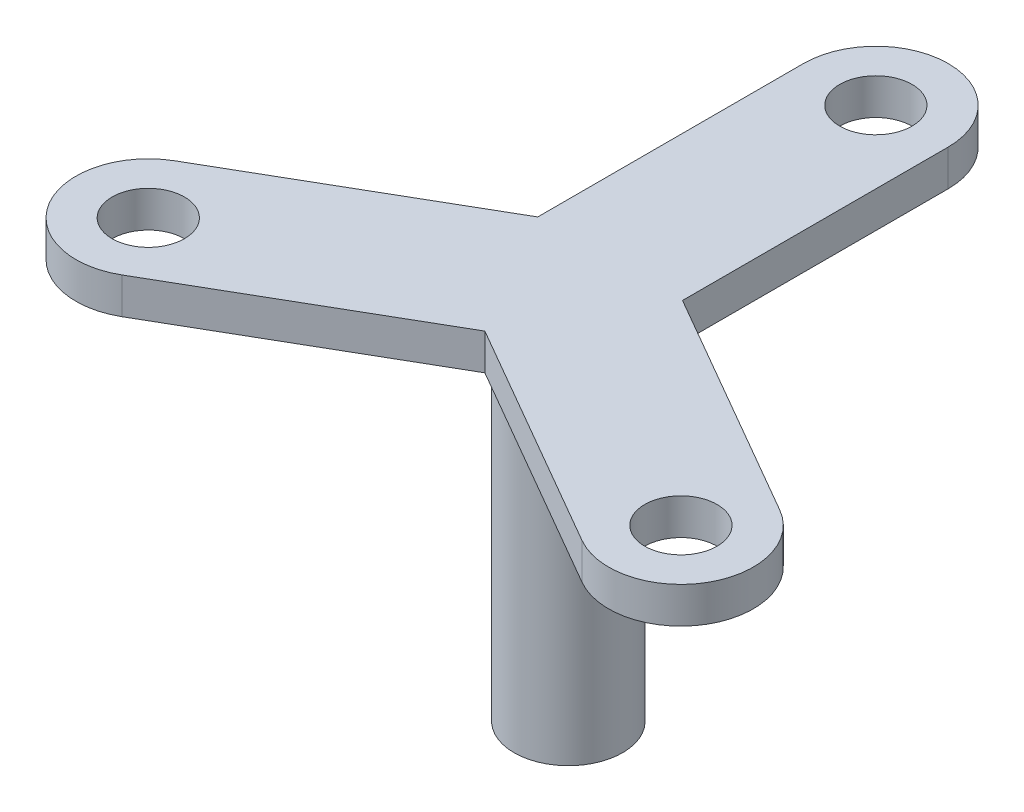
ISO-10303-21;
HEADER;
FILE_DESCRIPTION(('STEP AP214'),'2;1');
FILE_NAME('part.step','',(''),(''),'','','');
FILE_SCHEMA(('AUTOMOTIVE_DESIGN { 1 0 10303 214 1 1 1 1 }'));
ENDSEC;
DATA;
#1=APPLICATION_CONTEXT('core data for automotive mechanical design processes');
#2=APPLICATION_PROTOCOL_DEFINITION('international standard','automotive_design',2000,#1);
#3=PRODUCT_CONTEXT('',#1,'mechanical');
#4=PRODUCT('Part','Part','',(#3));
#5=PRODUCT_RELATED_PRODUCT_CATEGORY('part','',(#4));
#6=PRODUCT_DEFINITION_FORMATION('','',#4);
#7=PRODUCT_DEFINITION_CONTEXT('part definition',#1,'design');
#8=PRODUCT_DEFINITION('design','',#6,#7);
#9=PRODUCT_DEFINITION_SHAPE('','',#8);
#10=(LENGTH_UNIT() NAMED_UNIT(*) SI_UNIT(.MILLI.,.METRE.));
#11=(NAMED_UNIT(*) PLANE_ANGLE_UNIT() SI_UNIT($,.RADIAN.));
#12=(NAMED_UNIT(*) SI_UNIT($,.STERADIAN.) SOLID_ANGLE_UNIT());
#13=UNCERTAINTY_MEASURE_WITH_UNIT(LENGTH_MEASURE(1.E-05),#10,'distance_accuracy_value','');
#14=(GEOMETRIC_REPRESENTATION_CONTEXT(3) GLOBAL_UNCERTAINTY_ASSIGNED_CONTEXT((#13)) GLOBAL_UNIT_ASSIGNED_CONTEXT((#10,
#11,#12)) REPRESENTATION_CONTEXT('',''));
#15=CARTESIAN_POINT('',(0.,0.,0.));
#16=DIRECTION('',(0.,0.,1.));
#17=DIRECTION('',(1.,0.,0.));
#18=AXIS2_PLACEMENT_3D('',#15,#16,#17);
#19=CARTESIAN_POINT('',(0.,-6.99999999999999,0.));
#20=DIRECTION('',(0.,1.,0.));
#21=DIRECTION('',(-1.,0.,0.));
#22=AXIS2_PLACEMENT_3D('',#19,#20,#21);
#23=PLANE('',#22);
#24=CARTESIAN_POINT('',(0.,-6.99999999999999,0.));
#25=DIRECTION('',(0.,1.,0.));
#26=DIRECTION('',(-1.,0.,0.));
#27=AXIS2_PLACEMENT_3D('',#24,#25,#26);
#28=CIRCLE('',#27,1.);
#29=CARTESIAN_POINT('',(-1.,-6.99999999999999,0.));
#30=VERTEX_POINT('',#29);
#31=EDGE_CURVE('E11',#30,#30,#28,.F.);
#32=ORIENTED_EDGE('',*,*,#31,.F.);
#33=EDGE_LOOP('',(#32));
#34=FACE_BOUND('',#33,.T.);
#35=CARTESIAN_POINT('',(0.,-7.,0.));
#36=DIRECTION('',(0.,1.,0.));
#37=DIRECTION('',(0.,0.,1.));
#38=AXIS2_PLACEMENT_3D('',#35,#36,#37);
#39=CIRCLE('',#38,3.);
#40=CARTESIAN_POINT('',(0.,-7.,3.));
#41=VERTEX_POINT('',#40);
#42=EDGE_CURVE('E42',#41,#41,#39,.T.);
#43=ORIENTED_EDGE('',*,*,#42,.F.);
#44=EDGE_LOOP('',(#43));
#45=FACE_BOUND('',#44,.T.);
#46=ADVANCED_FACE('F34',(#34,#45),#23,.F.);
#47=CARTESIAN_POINT('',(0.,-2.,0.));
#48=DIRECTION('',(0.,-1.,0.));
#49=DIRECTION('',(0.,0.,-1.));
#50=AXIS2_PLACEMENT_3D('',#47,#48,#49);
#51=PLANE('',#50);
#52=CARTESIAN_POINT('',(0.,-2.,0.));
#53=DIRECTION('',(0.,-1.,0.));
#54=DIRECTION('',(0.,0.,-1.));
#55=AXIS2_PLACEMENT_3D('',#52,#53,#54);
#56=CIRCLE('',#55,1.);
#57=CARTESIAN_POINT('',(0.,-2.,-1.));
#58=VERTEX_POINT('',#57);
#59=EDGE_CURVE('E150',#58,#58,#56,.T.);
#60=ORIENTED_EDGE('',*,*,#59,.T.);
#61=EDGE_LOOP('',(#60));
#62=FACE_BOUND('',#61,.T.);
#63=ADVANCED_FACE('F200',(#62),#51,.T.);
#64=CARTESIAN_POINT('',(0.,-2.,0.));
#65=DIRECTION('',(0.,-1.,0.));
#66=DIRECTION('',(0.,0.,-1.));
#67=AXIS2_PLACEMENT_3D('',#64,#65,#66);
#68=CYLINDRICAL_SURFACE('',#67,1.);
#69=ORIENTED_EDGE('',*,*,#31,.T.);
#70=EDGE_LOOP('',(#69));
#71=FACE_BOUND('',#70,.T.);
#72=ORIENTED_EDGE('',*,*,#59,.F.);
#73=EDGE_LOOP('',(#72));
#74=FACE_BOUND('',#73,.T.);
#75=ADVANCED_FACE('F206',(#71,#74),#68,.F.);
#76=CARTESIAN_POINT('',(-4.,14.,0.));
#77=DIRECTION('',(-1.,0.,0.));
#78=DIRECTION('',(0.,0.,1.));
#79=AXIS2_PLACEMENT_3D('',#76,#77,#78);
#80=PLANE('',#79);
#81=DIRECTION('',(0.,0.,-1.));
#82=VECTOR('',#81,1.);
#83=CARTESIAN_POINT('',(-4.,12.,0.));
#84=LINE('',#83,#82);
#85=CARTESIAN_POINT('',(-4.,12.,-2.30766902595093));
#86=VERTEX_POINT('',#85);
#87=CARTESIAN_POINT('',(-4.,12.,-17.));
#88=VERTEX_POINT('',#87);
#89=EDGE_CURVE('E146',#86,#88,#84,.T.);
#90=ORIENTED_EDGE('',*,*,#89,.F.);
#91=DIRECTION('',(0.,-1.,0.));
#92=VECTOR('',#91,1.);
#93=CARTESIAN_POINT('',(-4.,14.,-2.30766902595093));
#94=LINE('',#93,#92);
#95=CARTESIAN_POINT('',(-4.,14.,-2.30766902595093));
#96=VERTEX_POINT('',#95);
#97=EDGE_CURVE('E93',#96,#86,#94,.T.);
#98=ORIENTED_EDGE('',*,*,#97,.F.);
#99=DIRECTION('',(0.,0.,-1.));
#100=VECTOR('',#99,1.);
#101=CARTESIAN_POINT('',(-4.,14.,0.));
#102=LINE('',#101,#100);
#103=CARTESIAN_POINT('',(-4.,14.,-17.));
#104=VERTEX_POINT('',#103);
#105=EDGE_CURVE('E176',#96,#104,#102,.T.);
#106=ORIENTED_EDGE('',*,*,#105,.T.);
#107=DIRECTION('',(0.,-1.,0.));
#108=VECTOR('',#107,1.);
#109=CARTESIAN_POINT('',(-4.,14.,-17.));
#110=LINE('',#109,#108);
#111=EDGE_CURVE('E88',#104,#88,#110,.T.);
#112=ORIENTED_EDGE('',*,*,#111,.T.);
#113=EDGE_LOOP('',(#90,#98,#106,#112));
#114=FACE_BOUND('',#113,.T.);
#115=ADVANCED_FACE('F261',(#114),#80,.T.);
#116=CARTESIAN_POINT('',(-1.99925,14.,-3.46280257703208));
#117=DIRECTION('',(0.5,0.,0.866025403784439));
#118=DIRECTION('',(0.866025403784439,0.,-0.5));
#119=AXIS2_PLACEMENT_3D('',#116,#117,#118);
#120=PLANE('',#119);
#121=DIRECTION('',(-0.866025403784439,0.,0.5));
#122=VECTOR('',#121,1.);
#123=CARTESIAN_POINT('',(-1.99925,12.,-3.46280257703208));
#124=LINE('',#123,#122);
#125=CARTESIAN_POINT('',(-16.7209318643355,12.,5.03676441026603));
#126=VERTEX_POINT('',#125);
#127=EDGE_CURVE('E149',#86,#126,#124,.T.);
#128=ORIENTED_EDGE('',*,*,#127,.T.);
#129=DIRECTION('',(0.,-1.,0.));
#130=VECTOR('',#129,1.);
#131=CARTESIAN_POINT('',(-16.7209318643355,14.,5.03676441026603));
#132=LINE('',#131,#130);
#133=CARTESIAN_POINT('',(-16.7209318643355,14.,5.03676441026603));
#134=VERTEX_POINT('',#133);
#135=EDGE_CURVE('E187',#134,#126,#132,.T.);
#136=ORIENTED_EDGE('',*,*,#135,.F.);
#137=DIRECTION('',(-0.866025403784439,0.,0.5));
#138=VECTOR('',#137,1.);
#139=CARTESIAN_POINT('',(-1.99925,14.,-3.46280257703208));
#140=LINE('',#139,#138);
#141=EDGE_CURVE('E281',#96,#134,#140,.T.);
#142=ORIENTED_EDGE('',*,*,#141,.F.);
#143=ORIENTED_EDGE('',*,*,#97,.T.);
#144=EDGE_LOOP('',(#128,#136,#142,#143));
#145=FACE_BOUND('',#144,.T.);
#146=ADVANCED_FACE('F258',(#145),#120,.F.);
#147=CARTESIAN_POINT('',(-14.7209318643355,14.,8.50086602540365));
#148=DIRECTION('',(0.,-1.,0.));
#149=DIRECTION('',(0.,0.,-1.));
#150=AXIS2_PLACEMENT_3D('',#147,#148,#149);
#151=CYLINDRICAL_SURFACE('',#150,4.);
#152=CARTESIAN_POINT('',(-14.7209318643355,12.,8.50086602540365));
#153=DIRECTION('',(0.,1.,0.));
#154=DIRECTION('',(0.,0.,1.));
#155=AXIS2_PLACEMENT_3D('',#152,#153,#154);
#156=CIRCLE('',#155,4.);
#157=CARTESIAN_POINT('',(-12.7209318643355,12.,11.9649676405415));
#158=VERTEX_POINT('',#157);
#159=EDGE_CURVE('E152',#126,#158,#156,.T.);
#160=ORIENTED_EDGE('',*,*,#159,.T.);
#161=DIRECTION('',(0.,-1.,0.));
#162=VECTOR('',#161,1.);
#163=CARTESIAN_POINT('',(-12.7209318643355,14.,11.9649676405415));
#164=LINE('',#163,#162);
#165=CARTESIAN_POINT('',(-12.7209318643355,14.,11.9649676405415));
#166=VERTEX_POINT('',#165);
#167=EDGE_CURVE('E185',#166,#158,#164,.T.);
#168=ORIENTED_EDGE('',*,*,#167,.F.);
#169=CARTESIAN_POINT('',(-14.7209318643355,14.,8.50086602540365));
#170=DIRECTION('',(0.,1.,0.));
#171=DIRECTION('',(0.,0.,1.));
#172=AXIS2_PLACEMENT_3D('',#169,#170,#171);
#173=CIRCLE('',#172,4.);
#174=EDGE_CURVE('E277',#134,#166,#173,.T.);
#175=ORIENTED_EDGE('',*,*,#174,.F.);
#176=ORIENTED_EDGE('',*,*,#135,.T.);
#177=EDGE_LOOP('',(#160,#168,#175,#176));
#178=FACE_BOUND('',#177,.T.);
#179=ADVANCED_FACE('F254',(#178),#151,.T.);
#180=CARTESIAN_POINT('',(2.00075,14.,3.46540065324343));
#181=DIRECTION('',(0.5,0.,0.866025403784439));
#182=DIRECTION('',(0.866025403784439,0.,-0.5));
#183=AXIS2_PLACEMENT_3D('',#180,#181,#182);
#184=PLANE('',#183);
#185=DIRECTION('',(-0.866025403784439,0.,0.5));
#186=VECTOR('',#185,1.);
#187=CARTESIAN_POINT('',(2.00075,12.,3.46540065324343));
#188=LINE('',#187,#186);
#189=CARTESIAN_POINT('',(0.00299999999999736,12.,4.618802153517));
#190=VERTEX_POINT('',#189);
#191=EDGE_CURVE('E155',#190,#158,#188,.T.);
#192=ORIENTED_EDGE('',*,*,#191,.F.);
#193=DIRECTION('',(0.,-1.,0.));
#194=VECTOR('',#193,1.);
#195=CARTESIAN_POINT('',(0.00299999999999736,14.,4.618802153517));
#196=LINE('',#195,#194);
#197=CARTESIAN_POINT('',(0.00299999999999736,14.,4.618802153517));
#198=VERTEX_POINT('',#197);
#199=EDGE_CURVE('E183',#198,#190,#196,.T.);
#200=ORIENTED_EDGE('',*,*,#199,.F.);
#201=DIRECTION('',(-0.866025403784439,0.,0.5));
#202=VECTOR('',#201,1.);
#203=CARTESIAN_POINT('',(2.00075,14.,3.46540065324343));
#204=LINE('',#203,#202);
#205=EDGE_CURVE('E280',#198,#166,#204,.T.);
#206=ORIENTED_EDGE('',*,*,#205,.T.);
#207=ORIENTED_EDGE('',*,*,#167,.T.);
#208=EDGE_LOOP('',(#192,#200,#206,#207));
#209=FACE_BOUND('',#208,.T.);
#210=ADVANCED_FACE('F250',(#209),#184,.T.);
#211=CARTESIAN_POINT('',(-1.99925,14.,3.46280257703208));
#212=DIRECTION('',(0.5,0.,-0.866025403784439));
#213=DIRECTION('',(-0.866025403784439,0.,-0.5));
#214=AXIS2_PLACEMENT_3D('',#211,#212,#213);
#215=PLANE('',#214);
#216=DIRECTION('',(0.866025403784439,0.,0.5));
#217=VECTOR('',#216,1.);
#218=CARTESIAN_POINT('',(-1.99925,12.,3.46280257703208));
#219=LINE('',#218,#217);
#220=CARTESIAN_POINT('',(12.7239318643355,12.,11.963235589734));
#221=VERTEX_POINT('',#220);
#222=EDGE_CURVE('E158',#190,#221,#219,.T.);
#223=ORIENTED_EDGE('',*,*,#222,.T.);
#224=DIRECTION('',(0.,-1.,0.));
#225=VECTOR('',#224,1.);
#226=CARTESIAN_POINT('',(12.7239318643355,14.,11.963235589734));
#227=LINE('',#226,#225);
#228=CARTESIAN_POINT('',(12.7239318643355,14.,11.963235589734));
#229=VERTEX_POINT('',#228);
#230=EDGE_CURVE('E180',#229,#221,#227,.T.);
#231=ORIENTED_EDGE('',*,*,#230,.F.);
#232=DIRECTION('',(0.866025403784439,0.,0.5));
#233=VECTOR('',#232,1.);
#234=CARTESIAN_POINT('',(-1.99925,14.,3.46280257703208));
#235=LINE('',#234,#233);
#236=EDGE_CURVE('E132',#198,#229,#235,.T.);
#237=ORIENTED_EDGE('',*,*,#236,.F.);
#238=ORIENTED_EDGE('',*,*,#199,.T.);
#239=EDGE_LOOP('',(#223,#231,#237,#238));
#240=FACE_BOUND('',#239,.T.);
#241=ADVANCED_FACE('F246',(#240),#215,.F.);
#242=CARTESIAN_POINT('',(14.7239318643354,14.,8.49913397459629));
#243=DIRECTION('',(0.,-1.,0.));
#244=DIRECTION('',(0.,0.,-1.));
#245=AXIS2_PLACEMENT_3D('',#242,#243,#244);
#246=CYLINDRICAL_SURFACE('',#245,4.);
#247=CARTESIAN_POINT('',(14.7239318643354,12.,8.49913397459629));
#248=DIRECTION('',(0.,1.,0.));
#249=DIRECTION('',(0.,0.,1.));
#250=AXIS2_PLACEMENT_3D('',#247,#248,#249);
#251=CIRCLE('',#250,4.);
#252=CARTESIAN_POINT('',(16.7239318643355,12.,5.03503235945846));
#253=VERTEX_POINT('',#252);
#254=EDGE_CURVE('E160',#221,#253,#251,.T.);
#255=ORIENTED_EDGE('',*,*,#254,.T.);
#256=DIRECTION('',(0.,-1.,0.));
#257=VECTOR('',#256,1.);
#258=CARTESIAN_POINT('',(16.7239318643355,14.,5.03503235945846));
#259=LINE('',#258,#257);
#260=CARTESIAN_POINT('',(16.7239318643355,14.,5.03503235945846));
#261=VERTEX_POINT('',#260);
#262=EDGE_CURVE('E120',#261,#253,#259,.T.);
#263=ORIENTED_EDGE('',*,*,#262,.F.);
#264=CARTESIAN_POINT('',(14.7239318643354,14.,8.49913397459629));
#265=DIRECTION('',(0.,1.,0.));
#266=DIRECTION('',(0.,0.,1.));
#267=AXIS2_PLACEMENT_3D('',#264,#265,#266);
#268=CIRCLE('',#267,4.);
#269=EDGE_CURVE('E129',#229,#261,#268,.T.);
#270=ORIENTED_EDGE('',*,*,#269,.F.);
#271=ORIENTED_EDGE('',*,*,#230,.T.);
#272=EDGE_LOOP('',(#255,#263,#270,#271));
#273=FACE_BOUND('',#272,.T.);
#274=ADVANCED_FACE('F243',(#273),#246,.T.);
#275=CARTESIAN_POINT('',(2.00075,14.,-3.46540065324343));
#276=DIRECTION('',(0.5,0.,-0.866025403784439));
#277=DIRECTION('',(-0.866025403784439,0.,-0.5));
#278=AXIS2_PLACEMENT_3D('',#275,#276,#277);
#279=PLANE('',#278);
#280=DIRECTION('',(0.866025403784439,0.,0.5));
#281=VECTOR('',#280,1.);
#282=CARTESIAN_POINT('',(2.00075,12.,-3.46540065324343));
#283=LINE('',#282,#281);
#284=CARTESIAN_POINT('',(4.,12.,-2.31113312756607));
#285=VERTEX_POINT('',#284);
#286=EDGE_CURVE('E119',#285,#253,#283,.T.);
#287=ORIENTED_EDGE('',*,*,#286,.F.);
#288=DIRECTION('',(0.,-1.,0.));
#289=VECTOR('',#288,1.);
#290=CARTESIAN_POINT('',(4.,14.,-2.31113312756607));
#291=LINE('',#290,#289);
#292=CARTESIAN_POINT('',(4.,14.,-2.31113312756607));
#293=VERTEX_POINT('',#292);
#294=EDGE_CURVE('E113',#293,#285,#291,.T.);
#295=ORIENTED_EDGE('',*,*,#294,.F.);
#296=DIRECTION('',(0.866025403784439,0.,0.5));
#297=VECTOR('',#296,1.);
#298=CARTESIAN_POINT('',(2.00075,14.,-3.46540065324343));
#299=LINE('',#298,#297);
#300=EDGE_CURVE('E117',#293,#261,#299,.T.);
#301=ORIENTED_EDGE('',*,*,#300,.T.);
#302=ORIENTED_EDGE('',*,*,#262,.T.);
#303=EDGE_LOOP('',(#287,#295,#301,#302));
#304=FACE_BOUND('',#303,.T.);
#305=ADVANCED_FACE('F115',(#304),#279,.T.);
#306=CARTESIAN_POINT('',(4.,14.,0.));
#307=DIRECTION('',(-1.,0.,0.));
#308=DIRECTION('',(0.,0.,1.));
#309=AXIS2_PLACEMENT_3D('',#306,#307,#308);
#310=PLANE('',#309);
#311=DIRECTION('',(0.,0.,-1.));
#312=VECTOR('',#311,1.);
#313=CARTESIAN_POINT('',(4.,12.,0.));
#314=LINE('',#313,#312);
#315=CARTESIAN_POINT('',(4.,12.,-17.));
#316=VERTEX_POINT('',#315);
#317=EDGE_CURVE('E81',#285,#316,#314,.T.);
#318=ORIENTED_EDGE('',*,*,#317,.T.);
#319=DIRECTION('',(0.,-1.,0.));
#320=VECTOR('',#319,1.);
#321=CARTESIAN_POINT('',(4.,14.,-17.));
#322=LINE('',#321,#320);
#323=CARTESIAN_POINT('',(4.,14.,-17.));
#324=VERTEX_POINT('',#323);
#325=EDGE_CURVE('E121',#324,#316,#322,.T.);
#326=ORIENTED_EDGE('',*,*,#325,.F.);
#327=DIRECTION('',(0.,0.,-1.));
#328=VECTOR('',#327,1.);
#329=CARTESIAN_POINT('',(4.,14.,0.));
#330=LINE('',#329,#328);
#331=EDGE_CURVE('E123',#293,#324,#330,.T.);
#332=ORIENTED_EDGE('',*,*,#331,.F.);
#333=ORIENTED_EDGE('',*,*,#294,.T.);
#334=EDGE_LOOP('',(#318,#326,#332,#333));
#335=FACE_BOUND('',#334,.T.);
#336=ADVANCED_FACE('F124',(#335),#310,.F.);
#337=CARTESIAN_POINT('',(14.7224318643354,14.,8.50000000000007));
#338=DIRECTION('',(0.,-1.,0.));
#339=DIRECTION('',(0.,0.,-1.));
#340=AXIS2_PLACEMENT_3D('',#337,#338,#339);
#341=CYLINDRICAL_SURFACE('',#340,2.00000000000001);
#342=CARTESIAN_POINT('',(14.7224318643354,14.,8.50000000000007));
#343=DIRECTION('',(0.,1.,0.));
#344=DIRECTION('',(0.,0.,1.));
#345=AXIS2_PLACEMENT_3D('',#342,#343,#344);
#346=CIRCLE('',#345,2.00000000000001);
#347=CARTESIAN_POINT('',(14.7224318643354,14.,10.5000000000001));
#348=VERTEX_POINT('',#347);
#349=EDGE_CURVE('E140',#348,#348,#346,.T.);
#350=ORIENTED_EDGE('',*,*,#349,.T.);
#351=EDGE_LOOP('',(#350));
#352=FACE_BOUND('',#351,.T.);
#353=CARTESIAN_POINT('',(14.7224318643354,12.,8.50000000000007));
#354=DIRECTION('',(0.,1.,0.));
#355=DIRECTION('',(0.,0.,1.));
#356=AXIS2_PLACEMENT_3D('',#353,#354,#355);
#357=CIRCLE('',#356,2.00000000000001);
#358=CARTESIAN_POINT('',(14.7224318643354,12.,10.5000000000001));
#359=VERTEX_POINT('',#358);
#360=EDGE_CURVE('E170',#359,#359,#357,.T.);
#361=ORIENTED_EDGE('',*,*,#360,.F.);
#362=EDGE_LOOP('',(#361));
#363=FACE_BOUND('',#362,.T.);
#364=ADVANCED_FACE('F228',(#352,#363),#341,.F.);
#365=CARTESIAN_POINT('',(0.,14.,-17.));
#366=DIRECTION('',(0.,-1.,0.));
#367=DIRECTION('',(0.,0.,-1.));
#368=AXIS2_PLACEMENT_3D('',#365,#366,#367);
#369=CYLINDRICAL_SURFACE('',#368,2.);
#370=CARTESIAN_POINT('',(0.,14.,-17.));
#371=DIRECTION('',(0.,1.,0.));
#372=DIRECTION('',(0.,0.,1.));
#373=AXIS2_PLACEMENT_3D('',#370,#371,#372);
#374=CIRCLE('',#373,2.);
#375=CARTESIAN_POINT('',(0.,14.,-15.));
#376=VERTEX_POINT('',#375);
#377=EDGE_CURVE('E137',#376,#376,#374,.T.);
#378=ORIENTED_EDGE('',*,*,#377,.T.);
#379=EDGE_LOOP('',(#378));
#380=FACE_BOUND('',#379,.T.);
#381=CARTESIAN_POINT('',(0.,12.,-17.));
#382=DIRECTION('',(0.,1.,0.));
#383=DIRECTION('',(0.,0.,1.));
#384=AXIS2_PLACEMENT_3D('',#381,#382,#383);
#385=CIRCLE('',#384,2.);
#386=CARTESIAN_POINT('',(0.,12.,-15.));
#387=VERTEX_POINT('',#386);
#388=EDGE_CURVE('E167',#387,#387,#385,.T.);
#389=ORIENTED_EDGE('',*,*,#388,.F.);
#390=EDGE_LOOP('',(#389));
#391=FACE_BOUND('',#390,.T.);
#392=ADVANCED_FACE('F231',(#380,#391),#369,.F.);
#393=CARTESIAN_POINT('',(0.,14.,-17.));
#394=DIRECTION('',(0.,-1.,0.));
#395=DIRECTION('',(0.,0.,-1.));
#396=AXIS2_PLACEMENT_3D('',#393,#394,#395);
#397=CYLINDRICAL_SURFACE('',#396,4.);
#398=CARTESIAN_POINT('',(0.,12.,-17.));
#399=DIRECTION('',(0.,1.,0.));
#400=DIRECTION('',(0.,0.,1.));
#401=AXIS2_PLACEMENT_3D('',#398,#399,#400);
#402=CIRCLE('',#401,4.);
#403=EDGE_CURVE('E165',#316,#88,#402,.T.);
#404=ORIENTED_EDGE('',*,*,#403,.T.);
#405=ORIENTED_EDGE('',*,*,#111,.F.);
#406=CARTESIAN_POINT('',(0.,14.,-17.));
#407=DIRECTION('',(0.,1.,0.));
#408=DIRECTION('',(0.,0.,1.));
#409=AXIS2_PLACEMENT_3D('',#406,#407,#408);
#410=CIRCLE('',#409,4.);
#411=EDGE_CURVE('E50',#324,#104,#410,.T.);
#412=ORIENTED_EDGE('',*,*,#411,.F.);
#413=ORIENTED_EDGE('',*,*,#325,.T.);
#414=EDGE_LOOP('',(#404,#405,#412,#413));
#415=FACE_BOUND('',#414,.T.);
#416=ADVANCED_FACE('F226',(#415),#397,.T.);
#417=CARTESIAN_POINT('',(-14.7224318643354,14.,8.50000000000007));
#418=DIRECTION('',(0.,-1.,0.));
#419=DIRECTION('',(0.,0.,-1.));
#420=AXIS2_PLACEMENT_3D('',#417,#418,#419);
#421=CYLINDRICAL_SURFACE('',#420,2.);
#422=CARTESIAN_POINT('',(-14.7224318643354,14.,8.50000000000007));
#423=DIRECTION('',(0.,1.,0.));
#424=DIRECTION('',(0.,0.,1.));
#425=AXIS2_PLACEMENT_3D('',#422,#423,#424);
#426=CIRCLE('',#425,2.);
#427=CARTESIAN_POINT('',(-14.7224318643354,14.,10.5000000000001));
#428=VERTEX_POINT('',#427);
#429=EDGE_CURVE('E143',#428,#428,#426,.T.);
#430=ORIENTED_EDGE('',*,*,#429,.T.);
#431=EDGE_LOOP('',(#430));
#432=FACE_BOUND('',#431,.T.);
#433=CARTESIAN_POINT('',(-14.7224318643354,12.,8.50000000000007));
#434=DIRECTION('',(0.,1.,0.));
#435=DIRECTION('',(0.,0.,1.));
#436=AXIS2_PLACEMENT_3D('',#433,#434,#435);
#437=CIRCLE('',#436,2.);
#438=CARTESIAN_POINT('',(-14.7224318643354,12.,10.5000000000001));
#439=VERTEX_POINT('',#438);
#440=EDGE_CURVE('E173',#439,#439,#437,.T.);
#441=ORIENTED_EDGE('',*,*,#440,.F.);
#442=EDGE_LOOP('',(#441));
#443=FACE_BOUND('',#442,.T.);
#444=ADVANCED_FACE('F222',(#432,#443),#421,.F.);
#445=CARTESIAN_POINT('',(0.,14.,0.));
#446=DIRECTION('',(0.,1.,0.));
#447=DIRECTION('',(0.,0.,1.));
#448=AXIS2_PLACEMENT_3D('',#445,#446,#447);
#449=PLANE('',#448);
#450=ORIENTED_EDGE('',*,*,#105,.F.);
#451=ORIENTED_EDGE('',*,*,#141,.T.);
#452=ORIENTED_EDGE('',*,*,#174,.T.);
#453=ORIENTED_EDGE('',*,*,#205,.F.);
#454=ORIENTED_EDGE('',*,*,#236,.T.);
#455=ORIENTED_EDGE('',*,*,#269,.T.);
#456=ORIENTED_EDGE('',*,*,#300,.F.);
#457=ORIENTED_EDGE('',*,*,#331,.T.);
#458=ORIENTED_EDGE('',*,*,#411,.T.);
#459=EDGE_LOOP('',(#450,#451,#452,#453,#454,#455,#456,#457,#458));
#460=FACE_BOUND('',#459,.T.);
#461=ORIENTED_EDGE('',*,*,#377,.F.);
#462=EDGE_LOOP('',(#461));
#463=FACE_BOUND('',#462,.T.);
#464=ORIENTED_EDGE('',*,*,#349,.F.);
#465=EDGE_LOOP('',(#464));
#466=FACE_BOUND('',#465,.T.);
#467=ORIENTED_EDGE('',*,*,#429,.F.);
#468=EDGE_LOOP('',(#467));
#469=FACE_BOUND('',#468,.T.);
#470=ADVANCED_FACE('F126',(#460,#463,#466,#469),#449,.T.);
#471=CARTESIAN_POINT('',(0.,12.,0.));
#472=DIRECTION('',(0.,1.,0.));
#473=DIRECTION('',(0.,0.,1.));
#474=AXIS2_PLACEMENT_3D('',#471,#472,#473);
#475=PLANE('',#474);
#476=CARTESIAN_POINT('',(0.,12.,0.));
#477=DIRECTION('',(0.,1.,0.));
#478=DIRECTION('',(0.,0.,1.));
#479=AXIS2_PLACEMENT_3D('',#476,#477,#478);
#480=CIRCLE('',#479,3.);
#481=CARTESIAN_POINT('',(0.,12.,3.));
#482=VERTEX_POINT('',#481);
#483=EDGE_CURVE('E191',#482,#482,#480,.F.);
#484=ORIENTED_EDGE('',*,*,#483,.F.);
#485=EDGE_LOOP('',(#484));
#486=FACE_BOUND('',#485,.T.);
#487=ORIENTED_EDGE('',*,*,#89,.T.);
#488=ORIENTED_EDGE('',*,*,#403,.F.);
#489=ORIENTED_EDGE('',*,*,#317,.F.);
#490=ORIENTED_EDGE('',*,*,#286,.T.);
#491=ORIENTED_EDGE('',*,*,#254,.F.);
#492=ORIENTED_EDGE('',*,*,#222,.F.);
#493=ORIENTED_EDGE('',*,*,#191,.T.);
#494=ORIENTED_EDGE('',*,*,#159,.F.);
#495=ORIENTED_EDGE('',*,*,#127,.F.);
#496=EDGE_LOOP('',(#487,#488,#489,#490,#491,#492,#493,#494,#495));
#497=FACE_BOUND('',#496,.T.);
#498=ORIENTED_EDGE('',*,*,#388,.T.);
#499=EDGE_LOOP('',(#498));
#500=FACE_BOUND('',#499,.T.);
#501=ORIENTED_EDGE('',*,*,#360,.T.);
#502=EDGE_LOOP('',(#501));
#503=FACE_BOUND('',#502,.T.);
#504=ORIENTED_EDGE('',*,*,#440,.T.);
#505=EDGE_LOOP('',(#504));
#506=FACE_BOUND('',#505,.T.);
#507=ADVANCED_FACE('F211',(#486,#497,#500,#503,#506),#475,.F.);
#508=CARTESIAN_POINT('',(0.,-10.,0.));
#509=DIRECTION('',(0.,1.,0.));
#510=DIRECTION('',(0.,0.,1.));
#511=AXIS2_PLACEMENT_3D('',#508,#509,#510);
#512=CYLINDRICAL_SURFACE('',#511,3.);
#513=ORIENTED_EDGE('',*,*,#42,.T.);
#514=EDGE_LOOP('',(#513));
#515=FACE_BOUND('',#514,.T.);
#516=ORIENTED_EDGE('',*,*,#483,.T.);
#517=EDGE_LOOP('',(#516));
#518=FACE_BOUND('',#517,.T.);
#519=ADVANCED_FACE('F196',(#515,#518),#512,.T.);
#520=CLOSED_SHELL('',(#46,#63,#75,#115,#146,#179,#210,#241,#274,#305,#336,#364,#392,#416,#444,
#470,#507,#519));
#521=MANIFOLD_SOLID_BREP('B2',#520);
#522=ADVANCED_BREP_SHAPE_REPRESENTATION('',(#18,#521),#14);
#523=SHAPE_DEFINITION_REPRESENTATION(#9,#522);
ENDSEC;
END-ISO-10303-21;
